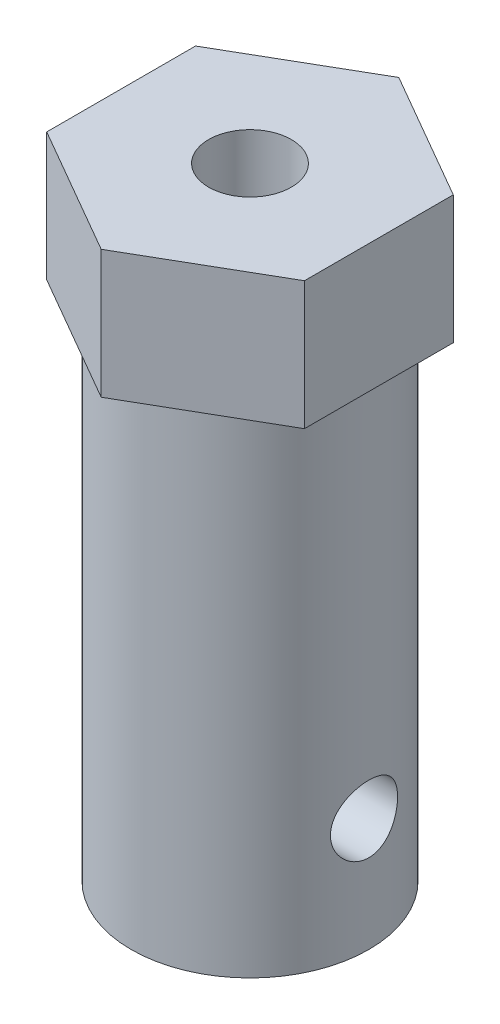
ISO-10303-21;
HEADER;
FILE_DESCRIPTION(('STEP AP214'),'2;1');
FILE_NAME('part.step','',(''),(''),'','','');
FILE_SCHEMA(('AUTOMOTIVE_DESIGN { 1 0 10303 214 1 1 1 1 }'));
ENDSEC;
DATA;
#1=APPLICATION_CONTEXT('core data for automotive mechanical design processes');
#2=APPLICATION_PROTOCOL_DEFINITION('international standard','automotive_design',2000,#1);
#3=PRODUCT_CONTEXT('',#1,'mechanical');
#4=PRODUCT('Part','Part','',(#3));
#5=PRODUCT_RELATED_PRODUCT_CATEGORY('part','',(#4));
#6=PRODUCT_DEFINITION_FORMATION('','',#4);
#7=PRODUCT_DEFINITION_CONTEXT('part definition',#1,'design');
#8=PRODUCT_DEFINITION('design','',#6,#7);
#9=PRODUCT_DEFINITION_SHAPE('','',#8);
#10=(LENGTH_UNIT() NAMED_UNIT(*) SI_UNIT(.MILLI.,.METRE.));
#11=(NAMED_UNIT(*) PLANE_ANGLE_UNIT() SI_UNIT($,.RADIAN.));
#12=(NAMED_UNIT(*) SI_UNIT($,.STERADIAN.) SOLID_ANGLE_UNIT());
#13=UNCERTAINTY_MEASURE_WITH_UNIT(LENGTH_MEASURE(1.E-05),#10,'distance_accuracy_value','');
#14=(GEOMETRIC_REPRESENTATION_CONTEXT(3) GLOBAL_UNCERTAINTY_ASSIGNED_CONTEXT((#13)) GLOBAL_UNIT_ASSIGNED_CONTEXT((#10,
#11,#12)) REPRESENTATION_CONTEXT('',''));
#15=CARTESIAN_POINT('',(0.,0.,0.));
#16=DIRECTION('',(0.,0.,1.));
#17=DIRECTION('',(1.,0.,0.));
#18=AXIS2_PLACEMENT_3D('',#15,#16,#17);
#19=CARTESIAN_POINT('',(0.,30.07,0.));
#20=DIRECTION('',(0.,-1.,0.));
#21=DIRECTION('',(0.,0.,-1.));
#22=AXIS2_PLACEMENT_3D('',#19,#20,#21);
#23=CYLINDRICAL_SURFACE('',#22,5.75);
#24=CARTESIAN_POINT('',(-5.51560286822755,5.475,-1.625));
#25=CARTESIAN_POINT('',(-5.51560417660316,5.56429865379306,-1.62499829342297));
#26=CARTESIAN_POINT('',(-5.51779523459764,5.65361467464507,-1.61761408905678));
#27=CARTESIAN_POINT('',(-5.52629249802826,5.82965247932958,-1.58833758679294));
#28=CARTESIAN_POINT('',(-5.5326004417256,5.91637315115183,-1.56643916053502));
#29=CARTESIAN_POINT('',(-5.54856125355561,6.08464754679471,-1.50892350216074));
#30=CARTESIAN_POINT('',(-5.5582090202718,6.16620892774442,-1.47332718370337));
#31=CARTESIAN_POINT('',(-5.57975573438554,6.32221847617706,-1.38949330030802));
#32=CARTESIAN_POINT('',(-5.59165493388297,6.39666584567586,-1.34125431949896));
#33=CARTESIAN_POINT('',(-5.61673841105354,6.53842478350228,-1.23205487310728));
#34=CARTESIAN_POINT('',(-5.62994765833726,6.6055069835706,-1.17080232047499));
#35=CARTESIAN_POINT('',(-5.65594841513746,6.72859665978229,-1.03794162530569));
#36=CARTESIAN_POINT('',(-5.66873987657006,6.78460286488884,-0.966332295897043));
#37=CARTESIAN_POINT('',(-5.69274477902532,6.88492551185041,-0.813181125241044));
#38=CARTESIAN_POINT('',(-5.70392534641986,6.92901120873354,-0.731482531271048));
#39=CARTESIAN_POINT('',(-5.72316054508144,7.00273190007674,-0.561462956647555));
#40=CARTESIAN_POINT('',(-5.73121577114259,7.0323696444503,-0.473143239903388));
#41=CARTESIAN_POINT('',(-5.74311607189646,7.07560303187119,-0.294785290294256));
#42=CARTESIAN_POINT('',(-5.74706353019839,7.08958948110942,-0.204848740174869));
#43=CARTESIAN_POINT('',(-5.75066269681404,7.10235567422968,-0.0238248503574743));
#44=CARTESIAN_POINT('',(-5.75031520915208,7.10113826431065,0.0672622707614818));
#45=CARTESIAN_POINT('',(-5.74543742828538,7.08380053107798,0.245271554906689));
#46=CARTESIAN_POINT('',(-5.74102577042347,7.0681028769638,0.332238639335848));
#47=CARTESIAN_POINT('',(-5.72865727042011,7.02293660960882,0.502249793183259));
#48=CARTESIAN_POINT('',(-5.72070021464281,6.99346716651297,0.585293625863668));
#49=CARTESIAN_POINT('',(-5.70196459385761,6.92128769049328,0.746145281496307));
#50=CARTESIAN_POINT('',(-5.691156551751,6.87843841565005,0.823887047240685));
#51=CARTESIAN_POINT('',(-5.66787520163886,6.78082391411251,0.971216746442098));
#52=CARTESIAN_POINT('',(-5.65540153552148,6.72605612331898,1.04080292037555));
#53=CARTESIAN_POINT('',(-5.62962718160372,6.60393898602874,1.17236954861864));
#54=CARTESIAN_POINT('',(-5.61631280390536,6.5362219858236,1.23400650107681));
#55=CARTESIAN_POINT('',(-5.59073880725537,6.39127790361115,1.34513951792674));
#56=CARTESIAN_POINT('',(-5.57847927013773,6.31405008488739,1.39463464091202));
#57=CARTESIAN_POINT('',(-5.55634293658501,6.15145833463614,1.48038443345665));
#58=CARTESIAN_POINT('',(-5.54648511901606,6.06603659094724,1.51653473485382));
#59=CARTESIAN_POINT('',(-5.53049843032644,5.88997759027522,1.57384314986441));
#60=CARTESIAN_POINT('',(-5.52436850156595,5.79934182055935,1.59500551598759));
#61=CARTESIAN_POINT('',(-5.51676018566672,5.61866680671758,1.6211221917671));
#62=CARTESIAN_POINT('',(-5.51513349976999,5.52870845979619,1.62659345991373));
#63=CARTESIAN_POINT('',(-5.5163080636355,5.34915994212107,1.62260598503335));
#64=CARTESIAN_POINT('',(-5.51910877493842,5.25956972792368,1.6131490575712));
#65=CARTESIAN_POINT('',(-5.52867821883202,5.08536764276082,1.58003165068348));
#66=CARTESIAN_POINT('',(-5.53535721639384,5.00068934188953,1.55669209655902));
#67=CARTESIAN_POINT('',(-5.55184053561251,4.83645218329522,1.49683799430948));
#68=CARTESIAN_POINT('',(-5.56164530127914,4.75689405481434,1.46032157433693));
#69=CARTESIAN_POINT('',(-5.58357193345863,4.60302074640142,1.37413314727155));
#70=CARTESIAN_POINT('',(-5.59574429566898,4.52887984825657,1.3241631471208));
#71=CARTESIAN_POINT('',(-5.62092071276065,4.38984618835401,1.21284810373815));
#72=CARTESIAN_POINT('',(-5.63392494351563,4.32495539167733,1.15150064984335));
#73=CARTESIAN_POINT('',(-5.65981841877676,4.2040648002513,1.01676252849305));
#74=CARTESIAN_POINT('',(-5.67268976043461,4.14842835278796,0.943041680714833));
#75=CARTESIAN_POINT('',(-5.69643141009309,4.0503144458545,0.787011443385554));
#76=CARTESIAN_POINT('',(-5.70730182334841,4.00783629413914,0.704702505950267));
#77=CARTESIAN_POINT('',(-5.7257472899883,3.93764843439488,0.534405450488067));
#78=CARTESIAN_POINT('',(-5.73334719967993,3.90982695686894,0.446466223456285));
#79=CARTESIAN_POINT('',(-5.74450509855077,3.86943284942777,0.266910694079794));
#80=CARTESIAN_POINT('',(-5.74806410311085,3.8568563887581,0.175295321453896));
#81=CARTESIAN_POINT('',(-5.75068474471028,3.84757351546582,-0.00563507616681675));
#82=CARTESIAN_POINT('',(-5.74989658676585,3.85033708895418,-0.0949210943488967));
#83=CARTESIAN_POINT('',(-5.74425781309807,3.8704082961624,-0.271704917169496));
#84=CARTESIAN_POINT('',(-5.7394073846302,3.88771525948646,-0.35920280404374));
#85=CARTESIAN_POINT('',(-5.72622514831989,3.93606825626258,-0.529206463264629));
#86=CARTESIAN_POINT('',(-5.71792356334072,3.96699515191079,-0.611748622323683));
#87=CARTESIAN_POINT('',(-5.6987019453656,4.04160416078007,-0.7705183553819));
#88=CARTESIAN_POINT('',(-5.68778151289487,4.08528822017997,-0.846744963628009));
#89=CARTESIAN_POINT('',(-5.66408318788558,4.1856571233163,-0.993138916555945));
#90=CARTESIAN_POINT('',(-5.65126032070257,4.24268475455693,-1.06306392291041));
#91=CARTESIAN_POINT('',(-5.62536572054518,4.36748728800809,-1.19253026287679));
#92=CARTESIAN_POINT('',(-5.6122939202683,4.43526513405551,-1.25206874283899));
#93=CARTESIAN_POINT('',(-5.58699296712128,4.58172434685009,-1.36058805712579));
#94=CARTESIAN_POINT('',(-5.57479385620146,4.66063994957478,-1.40926046576311));
#95=CARTESIAN_POINT('',(-5.55306788302131,4.82586871784492,-1.49258259169523));
#96=CARTESIAN_POINT('',(-5.54353948280427,4.91217758835523,-1.52724038456499));
#97=CARTESIAN_POINT('',(-5.5293828544327,5.07748109376031,-1.57766002800148));
#98=CARTESIAN_POINT('',(-5.52426032250385,5.15584477329296,-1.59536760073286));
#99=CARTESIAN_POINT('',(-5.51736999250293,5.31446781439135,-1.61903747440359));
#100=CARTESIAN_POINT('',(-5.51560169209136,5.39472689027391,-1.62500153409082));
#101=CARTESIAN_POINT('',(-5.51560286822755,5.475,-1.625));
#102=B_SPLINE_CURVE_WITH_KNOTS('',3,(#24,#25,#26,#27,#28,#29,#30,#31,#32,#33,#34,#35,#36,#37,
#38,#39,#40,#41,#42,#43,#44,#45,#46,#47,#48,#49,#50,#51,#52,#53,#54,#55,#56,#57,#58,#59,#60,#61,
#62,#63,#64,#65,#66,#67,#68,#69,#70,#71,#72,#73,#74,#75,#76,#77,#78,#79,#80,#81,#82,#83,#84,#85,
#86,#87,#88,#89,#90,#91,#92,#93,#94,#95,#96,#97,#98,#99,#100,#101),.UNSPECIFIED.,.T.,.F.,(4,2,2,
2,2,2,2,2,2,2,2,2,2,2,2,2,2,2,2,2,2,2,2,2,2,2,2,2,2,2,2,2,2,2,2,2,2,2,4),(0.,0.267600361875047,
0.535313785066746,0.802620080333404,1.06995632444201,1.34408507472553,1.61824526469603,
1.8973839806002,2.17646954659856,2.44841913376607,2.720317812081,2.98452281586096,
3.24874374205551,3.51581156456791,3.78293689982543,4.05924098980623,4.33556649602475,
4.61400948728768,4.89237344455494,5.16145477153547,5.43050337540751,5.69356170167318,
5.9566574115659,6.22614345468035,6.49568666205603,6.77411002172573,7.0525187313225,
7.32877242912246,7.60495669573642,7.87165924151668,8.13834949398295,8.40275187647929,
8.6671946161727,8.93936949607837,9.21161903739504,9.49082077026431,9.76986139000983,
10.0104510306059,10.2510046369494),.UNSPECIFIED.);
#103=CARTESIAN_POINT('',(-5.51560286822755,5.475,-1.625));
#104=VERTEX_POINT('',#103);
#105=EDGE_CURVE('E213',#104,#104,#102,.T.);
#106=ORIENTED_EDGE('',*,*,#105,.T.);
#107=EDGE_LOOP('',(#106));
#108=FACE_BOUND('',#107,.T.);
#109=CARTESIAN_POINT('',(5.51560286822755,5.475,-1.625));
#110=CARTESIAN_POINT('',(5.51560417660316,5.38570134620694,-1.62499829342297));
#111=CARTESIAN_POINT('',(5.51779523459764,5.29638532535493,-1.61761408905678));
#112=CARTESIAN_POINT('',(5.52629249802826,5.12034752067042,-1.58833758679294));
#113=CARTESIAN_POINT('',(5.5326004417256,5.03362684884817,-1.56643916053502));
#114=CARTESIAN_POINT('',(5.54856125355561,4.86535245320529,-1.50892350216074));
#115=CARTESIAN_POINT('',(5.5582090202718,4.78379107225558,-1.47332718370337));
#116=CARTESIAN_POINT('',(5.57975573438554,4.62778152382294,-1.38949330030802));
#117=CARTESIAN_POINT('',(5.59165493388297,4.55333415432414,-1.34125431949896));
#118=CARTESIAN_POINT('',(5.61673841105354,4.41157521649772,-1.23205487310728));
#119=CARTESIAN_POINT('',(5.62994765833726,4.3444930164294,-1.17080232047499));
#120=CARTESIAN_POINT('',(5.65594841513746,4.22140334021771,-1.03794162530569));
#121=CARTESIAN_POINT('',(5.66873987657006,4.16539713511116,-0.966332295897042));
#122=CARTESIAN_POINT('',(5.69274477902532,4.06507448814959,-0.813181125241044));
#123=CARTESIAN_POINT('',(5.70392534641986,4.02098879126646,-0.731482531271047));
#124=CARTESIAN_POINT('',(5.72316054508144,3.94726809992326,-0.561462956647555));
#125=CARTESIAN_POINT('',(5.73121577114259,3.9176303555497,-0.473143239903387));
#126=CARTESIAN_POINT('',(5.74311607189646,3.87439696812881,-0.294785290294255));
#127=CARTESIAN_POINT('',(5.74706353019839,3.86041051889058,-0.204848740174868));
#128=CARTESIAN_POINT('',(5.75066269681404,3.84764432577032,-0.0238248503574734));
#129=CARTESIAN_POINT('',(5.75031520915208,3.84886173568935,0.0672622707614827));
#130=CARTESIAN_POINT('',(5.74543742828538,3.86619946892202,0.24527155490669));
#131=CARTESIAN_POINT('',(5.74102577042347,3.8818971230362,0.332238639335849));
#132=CARTESIAN_POINT('',(5.72865727042011,3.92706339039117,0.50224979318326));
#133=CARTESIAN_POINT('',(5.72070021464282,3.95653283348704,0.585293625863669));
#134=CARTESIAN_POINT('',(5.70196459385761,4.02871230950672,0.746145281496308));
#135=CARTESIAN_POINT('',(5.691156551751,4.07156158434995,0.823887047240687));
#136=CARTESIAN_POINT('',(5.66787520163886,4.16917608588749,0.9712167464421));
#137=CARTESIAN_POINT('',(5.65540153552148,4.22394387668103,1.04080292037555));
#138=CARTESIAN_POINT('',(5.62962718160372,4.34606101397126,1.17236954861865));
#139=CARTESIAN_POINT('',(5.61631280390536,4.4137780141764,1.23400650107681));
#140=CARTESIAN_POINT('',(5.59073880725537,4.55872209638885,1.34513951792674));
#141=CARTESIAN_POINT('',(5.57847927013773,4.63594991511262,1.39463464091202));
#142=CARTESIAN_POINT('',(5.55634293658501,4.79854166536386,1.48038443345665));
#143=CARTESIAN_POINT('',(5.54648511901606,4.88396340905276,1.51653473485382));
#144=CARTESIAN_POINT('',(5.53049843032644,5.06002240972478,1.57384314986441));
#145=CARTESIAN_POINT('',(5.52436850156595,5.15065817944065,1.59500551598759));
#146=CARTESIAN_POINT('',(5.51676018566672,5.33133319328242,1.6211221917671));
#147=CARTESIAN_POINT('',(5.51513349976999,5.42129154020381,1.62659345991373));
#148=CARTESIAN_POINT('',(5.5163080636355,5.60084005787893,1.62260598503335));
#149=CARTESIAN_POINT('',(5.51910877493842,5.69043027207632,1.6131490575712));
#150=CARTESIAN_POINT('',(5.52867821883202,5.86463235723918,1.58003165068348));
#151=CARTESIAN_POINT('',(5.53535721639384,5.94931065811047,1.55669209655902));
#152=CARTESIAN_POINT('',(5.55184053561251,6.11354781670478,1.49683799430948));
#153=CARTESIAN_POINT('',(5.56164530127914,6.19310594518566,1.46032157433693));
#154=CARTESIAN_POINT('',(5.58357193345863,6.34697925359858,1.37413314727155));
#155=CARTESIAN_POINT('',(5.59574429566898,6.42112015174343,1.3241631471208));
#156=CARTESIAN_POINT('',(5.62092071276065,6.56015381164599,1.21284810373815));
#157=CARTESIAN_POINT('',(5.63392494351563,6.62504460832267,1.15150064984335));
#158=CARTESIAN_POINT('',(5.65981841877676,6.7459351997487,1.01676252849305));
#159=CARTESIAN_POINT('',(5.67268976043461,6.80157164721204,0.943041680714832));
#160=CARTESIAN_POINT('',(5.69643141009309,6.8996855541455,0.787011443385554));
#161=CARTESIAN_POINT('',(5.70730182334841,6.94216370586086,0.704702505950266));
#162=CARTESIAN_POINT('',(5.7257472899883,7.01235156560512,0.534405450488066));
#163=CARTESIAN_POINT('',(5.73334719967993,7.04017304313106,0.446466223456284));
#164=CARTESIAN_POINT('',(5.74450509855077,7.08056715057223,0.266910694079793));
#165=CARTESIAN_POINT('',(5.74806410311085,7.0931436112419,0.175295321453895));
#166=CARTESIAN_POINT('',(5.75068474471028,7.10242648453418,-0.00563507616681751));
#167=CARTESIAN_POINT('',(5.74989658676585,7.09966291104582,-0.0949210943488972));
#168=CARTESIAN_POINT('',(5.74425781309807,7.0795917038376,-0.271704917169496));
#169=CARTESIAN_POINT('',(5.7394073846302,7.06228474051354,-0.359202804043741));
#170=CARTESIAN_POINT('',(5.72622514831989,7.01393174373742,-0.529206463264629));
#171=CARTESIAN_POINT('',(5.71792356334072,6.98300484808921,-0.611748622323683));
#172=CARTESIAN_POINT('',(5.6987019453656,6.90839583921993,-0.7705183553819));
#173=CARTESIAN_POINT('',(5.68778151289487,6.86471177982003,-0.846744963628009));
#174=CARTESIAN_POINT('',(5.66408318788558,6.7643428766837,-0.993138916555945));
#175=CARTESIAN_POINT('',(5.65126032070257,6.70731524544307,-1.06306392291041));
#176=CARTESIAN_POINT('',(5.62536572054518,6.58251271199191,-1.19253026287679));
#177=CARTESIAN_POINT('',(5.6122939202683,6.51473486594449,-1.25206874283899));
#178=CARTESIAN_POINT('',(5.58699296712128,6.36827565314991,-1.36058805712579));
#179=CARTESIAN_POINT('',(5.57479385620146,6.28936005042522,-1.40926046576311));
#180=CARTESIAN_POINT('',(5.55306788302131,6.12413128215508,-1.49258259169523));
#181=CARTESIAN_POINT('',(5.54353948280428,6.03782241164477,-1.52724038456499));
#182=CARTESIAN_POINT('',(5.5293828544327,5.87251890623969,-1.57766002800148));
#183=CARTESIAN_POINT('',(5.52426032250385,5.79415522670705,-1.59536760073286));
#184=CARTESIAN_POINT('',(5.51736999250293,5.63553218560865,-1.61903747440359));
#185=CARTESIAN_POINT('',(5.51560169209136,5.55527310972609,-1.62500153409082));
#186=CARTESIAN_POINT('',(5.51560286822755,5.475,-1.625));
#187=B_SPLINE_CURVE_WITH_KNOTS('',3,(#109,#110,#111,#112,#113,#114,#115,#116,#117,#118,#119,
#120,#121,#122,#123,#124,#125,#126,#127,#128,#129,#130,#131,#132,#133,#134,#135,#136,#137,#138,
#139,#140,#141,#142,#143,#144,#145,#146,#147,#148,#149,#150,#151,#152,#153,#154,#155,#156,#157,
#158,#159,#160,#161,#162,#163,#164,#165,#166,#167,#168,#169,#170,#171,#172,#173,#174,#175,#176,
#177,#178,#179,#180,#181,#182,#183,#184,#185,#186),.UNSPECIFIED.,.T.,.F.,(4,2,2,2,2,2,2,2,2,2,2,
2,2,2,2,2,2,2,2,2,2,2,2,2,2,2,2,2,2,2,2,2,2,2,2,2,2,2,4),(0.,0.267600361875047,
0.535313785066747,0.802620080333405,1.06995632444202,1.34408507472553,1.61824526469603,
1.8973839806002,2.17646954659856,2.44841913376607,2.720317812081,2.98452281586096,
3.24874374205551,3.51581156456792,3.78293689982544,4.05924098980623,4.33556649602476,
4.61400948728768,4.89237344455494,5.16145477153547,5.43050337540751,5.69356170167318,
5.95665741156591,6.22614345468035,6.49568666205603,6.77411002172573,7.0525187313225,
7.32877242912246,7.60495669573642,7.87165924151668,8.13834949398295,8.4027518764793,
8.66719461617271,8.93936949607837,9.21161903739504,9.49082077026431,9.76986139000984,
10.0104510306059,10.2510046369494),.UNSPECIFIED.);
#188=CARTESIAN_POINT('',(5.51560286822755,5.475,-1.625));
#189=VERTEX_POINT('',#188);
#190=EDGE_CURVE('E207',#189,#189,#187,.T.);
#191=ORIENTED_EDGE('',*,*,#190,.T.);
#192=EDGE_LOOP('',(#191));
#193=FACE_BOUND('',#192,.T.);
#194=CARTESIAN_POINT('',(0.,0.,0.));
#195=DIRECTION('',(0.,1.,0.));
#196=DIRECTION('',(0.,0.,1.));
#197=AXIS2_PLACEMENT_3D('',#194,#195,#196);
#198=CIRCLE('',#197,5.75);
#199=CARTESIAN_POINT('',(0.,0.,5.75));
#200=VERTEX_POINT('',#199);
#201=EDGE_CURVE('E178',#200,#200,#198,.T.);
#202=ORIENTED_EDGE('',*,*,#201,.T.);
#203=EDGE_LOOP('',(#202));
#204=FACE_BOUND('',#203,.T.);
#205=CARTESIAN_POINT('',(0.,23.87,0.));
#206=DIRECTION('',(0.,1.,0.));
#207=DIRECTION('',(0.,0.,1.));
#208=AXIS2_PLACEMENT_3D('',#205,#206,#207);
#209=CIRCLE('',#208,5.75);
#210=CARTESIAN_POINT('',(0.,23.87,5.75));
#211=VERTEX_POINT('',#210);
#212=EDGE_CURVE('E11',#211,#211,#209,.T.);
#213=ORIENTED_EDGE('',*,*,#212,.F.);
#214=EDGE_LOOP('',(#213));
#215=FACE_BOUND('',#214,.T.);
#216=ADVANCED_FACE('F38',(#108,#193,#204,#215),#23,.T.);
#217=CARTESIAN_POINT('',(0.,0.,0.));
#218=DIRECTION('',(0.,1.,0.));
#219=DIRECTION('',(0.,0.,1.));
#220=AXIS2_PLACEMENT_3D('',#217,#218,#219);
#221=CYLINDRICAL_SURFACE('',#220,3.34);
#222=CARTESIAN_POINT('',(-2.91804300859326,5.475,-1.625));
#223=CARTESIAN_POINT('',(-2.91804976005883,5.38997542525232,-1.62499442384154));
#224=CARTESIAN_POINT('',(-2.9218149984292,5.30483560724234,-1.61828284987486));
#225=CARTESIAN_POINT('',(-2.9363406411164,5.13714108359835,-1.59176581656082));
#226=CARTESIAN_POINT('',(-2.94711652831724,5.05459252470226,-1.57193137396055));
#227=CARTESIAN_POINT('',(-2.97412292230692,4.89481930023772,-1.52020760690314));
#228=CARTESIAN_POINT('',(-2.99032559202378,4.81756984094225,-1.48837970162152));
#229=CARTESIAN_POINT('',(-3.02631706947505,4.66952589123785,-1.41375935497255));
#230=CARTESIAN_POINT('',(-3.04610590311996,4.5987314474728,-1.37096683438351));
#231=CARTESIAN_POINT('',(-3.08892591826826,4.45951256355307,-1.27172121812721));
#232=CARTESIAN_POINT('',(-3.11208958675368,4.39170192400024,-1.2144638719736));
#233=CARTESIAN_POINT('',(-3.15797733462039,4.26617259925702,-1.08958925293965));
#234=CARTESIAN_POINT('',(-3.18070119986454,4.2084587253776,-1.02196706964568));
#235=CARTESIAN_POINT('',(-3.22486253653109,4.10120871232759,-0.873072379502813));
#236=CARTESIAN_POINT('',(-3.24612880917962,4.05241670627999,-0.791208338062668));
#237=CARTESIAN_POINT('',(-3.28327627114841,3.96957531965864,-0.619206254071386));
#238=CARTESIAN_POINT('',(-3.29916068085726,3.93551711930929,-0.529073200697011));
#239=CARTESIAN_POINT('',(-3.32280275158299,3.8855050536807,-0.349585302698653));
#240=CARTESIAN_POINT('',(-3.33103942157056,3.868477940988,-0.260594006527878));
#241=CARTESIAN_POINT('',(-3.34023798946381,3.84948828924259,-0.0806650213564646));
#242=CARTESIAN_POINT('',(-3.34120402361224,3.84751718486273,0.0102715314575794));
#243=CARTESIAN_POINT('',(-3.33598925730552,3.85825541381376,0.183487439809333));
#244=CARTESIAN_POINT('',(-3.33039110207279,3.86976783540924,0.265862434427483));
#245=CARTESIAN_POINT('',(-3.31354387894068,3.90502004074335,0.427338812593501));
#246=CARTESIAN_POINT('',(-3.30229438981509,3.92876073592843,0.506439951646442));
#247=CARTESIAN_POINT('',(-3.2749816641775,3.98798022998959,0.660539543204467));
#248=CARTESIAN_POINT('',(-3.25885162225746,4.02362269185549,0.735462770073897));
#249=CARTESIAN_POINT('',(-3.22325295586211,4.10542361119009,0.878451801538527));
#250=CARTESIAN_POINT('',(-3.20378311929576,4.15158588855555,0.946515102215552));
#251=CARTESIAN_POINT('',(-3.16126985294014,4.25793830428353,1.08043771996552));
#252=CARTESIAN_POINT('',(-3.13806246516681,4.31902122188745,1.14553668388549));
#253=CARTESIAN_POINT('',(-3.09185593979215,4.45107434850219,1.2649646512955));
#254=CARTESIAN_POINT('',(-3.06885695831077,4.52205140686174,1.31928613025716));
#255=CARTESIAN_POINT('',(-3.02425456350093,4.67691338661715,1.41866962801354));
#256=CARTESIAN_POINT('',(-3.00280819251396,4.76130672765648,1.46301672424018));
#257=CARTESIAN_POINT('',(-2.96585996025852,4.93765386817421,1.53654998605012));
#258=CARTESIAN_POINT('',(-2.95035218485563,5.02960003449464,1.56575124541326));
#259=CARTESIAN_POINT('',(-2.92869825538592,5.21090117757321,1.60586792490121));
#260=CARTESIAN_POINT('',(-2.92191838736615,5.29990248350445,1.6180277414102));
#261=CARTESIAN_POINT('',(-2.91667771343232,5.47891207997264,1.62746075208073));
#262=CARTESIAN_POINT('',(-2.91821171024942,5.56891970631034,1.62474324653211));
#263=CARTESIAN_POINT('',(-2.92875541915787,5.73772839497872,1.60564069389593));
#264=CARTESIAN_POINT('',(-2.93699560467067,5.81674419773692,1.59066165524411));
#265=CARTESIAN_POINT('',(-2.95891201192384,5.97100673335276,1.54950926039207));
#266=CARTESIAN_POINT('',(-2.97258988303268,6.04625231481521,1.52333250749796));
#267=CARTESIAN_POINT('',(-3.00459147528454,6.19479718963235,1.45923434133128));
#268=CARTESIAN_POINT('',(-3.02310140493879,6.2678439391144,1.42082408782913));
#269=CARTESIAN_POINT('',(-3.062499281058,6.40686928850959,1.33378374075606));
#270=CARTESIAN_POINT('',(-3.08338843375784,6.47284426993278,1.28514845256283));
#271=CARTESIAN_POINT('',(-3.12815719470902,6.60399543184501,1.17231877994646));
#272=CARTESIAN_POINT('',(-3.15209872579283,6.668157955757,1.10696542997073));
#273=CARTESIAN_POINT('',(-3.1981140120787,6.78490053630133,0.966003017820354));
#274=CARTESIAN_POINT('',(-3.22018723877044,6.83747732223271,0.890391069310117));
#275=CARTESIAN_POINT('',(-3.26060420214438,6.93045784208405,0.728789260202494));
#276=CARTESIAN_POINT('',(-3.27885865101549,6.97057894486833,0.642612907057672));
#277=CARTESIAN_POINT('',(-3.30891112641567,7.03536781927002,0.463592049068459));
#278=CARTESIAN_POINT('',(-3.3207145194997,7.06004843811913,0.370753159674315));
#279=CARTESIAN_POINT('',(-3.33571981575368,7.09123573853148,0.189916945734807));
#280=CARTESIAN_POINT('',(-3.33959065611099,7.09915783195959,0.10221855150251));
#281=CARTESIAN_POINT('',(-3.34034684723765,7.10071371120034,-0.0733229253511546));
#282=CARTESIAN_POINT('',(-3.33723438715967,7.09435197476409,-0.161165954005466));
#283=CARTESIAN_POINT('',(-3.32476324562683,7.06848379320307,-0.328949343545443));
#284=CARTESIAN_POINT('',(-3.31579200902171,7.04979201442206,-0.409047040739861));
#285=CARTESIAN_POINT('',(-3.2928320403603,7.00085498668811,-0.564856535385057));
#286=CARTESIAN_POINT('',(-3.27884255085357,6.97060799355701,-0.640567668727071));
#287=CARTESIAN_POINT('',(-3.2463550922209,6.89800574703135,-0.789189936989615));
#288=CARTESIAN_POINT('',(-3.22768550904769,6.85517535267663,-0.861830356907343));
#289=CARTESIAN_POINT('',(-3.18783898396979,6.75922974379929,-0.999203089421628));
#290=CARTESIAN_POINT('',(-3.16666089034172,6.70610979790515,-1.06393174158779));
#291=CARTESIAN_POINT('',(-3.12156699024656,6.58524360048637,-1.19009279647811));
#292=CARTESIAN_POINT('',(-3.09758186397022,6.51658857013812,-1.25063237432455));
#293=CARTESIAN_POINT('',(-3.05131585419779,6.36965602582863,-1.3596275487351));
#294=CARTESIAN_POINT('',(-3.02903635546268,6.2913708249804,-1.4080733973166));
#295=CARTESIAN_POINT('',(-2.98841176116418,6.12484372156964,-1.49239547984207));
#296=CARTESIAN_POINT('',(-2.97017255844621,6.03640965040691,-1.52794620524334));
#297=CARTESIAN_POINT('',(-2.94114790746247,5.85370215440564,-1.58311312510418));
#298=CARTESIAN_POINT('',(-2.93033747941817,5.75944947202427,-1.60278276027264));
#299=CARTESIAN_POINT('',(-2.9221323917402,5.63272623605161,-1.61763746746193));
#300=CARTESIAN_POINT('',(-2.92060361620918,5.60126973898214,-1.62039461237484));
#301=CARTESIAN_POINT('',(-2.91855763848832,5.53821414487903,-1.62407697136876));
#302=CARTESIAN_POINT('',(-2.91804049816789,5.50661503924221,-1.62500207340606));
#303=CARTESIAN_POINT('',(-2.91804300859326,5.475,-1.625));
#304=B_SPLINE_CURVE_WITH_KNOTS('',3,(#222,#223,#224,#225,#226,#227,#228,#229,#230,#231,#232,
#233,#234,#235,#236,#237,#238,#239,#240,#241,#242,#243,#244,#245,#246,#247,#248,#249,#250,#251,
#252,#253,#254,#255,#256,#257,#258,#259,#260,#261,#262,#263,#264,#265,#266,#267,#268,#269,#270,
#271,#272,#273,#274,#275,#276,#277,#278,#279,#280,#281,#282,#283,#284,#285,#286,#287,#288,#289,
#290,#291,#292,#293,#294,#295,#296,#297,#298,#299,#300,#301,#302,#303),.UNSPECIFIED.,.T.,.F.,(4,
2,2,2,2,2,2,2,2,2,2,2,2,2,2,2,2,2,2,2,2,2,2,2,2,2,2,2,2,2,2,2,2,2,2,2,2,2,2,2,4),(0.,
0.254940807677494,0.510446567329305,0.764661268293461,1.01887780606493,1.29288960755969,
1.56703162759946,1.85844227869623,2.14967824681968,2.42111799947116,2.6924033191868,
2.94132287985667,3.19026099667725,3.44277385089733,3.69537854269157,3.97090367559325,
4.24662050044054,4.53824263047053,4.8295735795815,5.09827059012597,5.36679964876315,
5.608247591945,5.84976882749188,6.10250301363999,6.35536590789723,6.63807839923744,
6.92087059950691,7.20967629643462,7.49824137229702,7.76126168322789,8.02419955303067,
8.27130289835387,8.5184435569319,8.77648289177361,9.03464116188916,9.31724996870114,
9.60008583819955,9.88963247279002,10.1782006585633,10.2729905564105,10.3677862512209),.UNSPECIFIED.);
#305=CARTESIAN_POINT('',(-2.91804300859326,5.475,-1.625));
#306=VERTEX_POINT('',#305);
#307=EDGE_CURVE('E42',#306,#306,#304,.T.);
#308=ORIENTED_EDGE('',*,*,#307,.T.);
#309=EDGE_LOOP('',(#308));
#310=FACE_BOUND('',#309,.T.);
#311=CARTESIAN_POINT('',(2.91804300859326,5.475,-1.625));
#312=CARTESIAN_POINT('',(2.91804976005883,5.56002457474768,-1.62499442384154));
#313=CARTESIAN_POINT('',(2.92181499842921,5.64516439275766,-1.61828284987486));
#314=CARTESIAN_POINT('',(2.9363406411164,5.81285891640165,-1.59176581656082));
#315=CARTESIAN_POINT('',(2.94711652831724,5.89540747529774,-1.57193137396055));
#316=CARTESIAN_POINT('',(2.97412292230692,6.05518069976228,-1.52020760690314));
#317=CARTESIAN_POINT('',(2.99032559202378,6.13243015905775,-1.48837970162152));
#318=CARTESIAN_POINT('',(3.02631706947505,6.28047410876215,-1.41375935497255));
#319=CARTESIAN_POINT('',(3.04610590311996,6.3512685525272,-1.37096683438351));
#320=CARTESIAN_POINT('',(3.08892591826826,6.49048743644693,-1.27172121812721));
#321=CARTESIAN_POINT('',(3.11208958675368,6.55829807599976,-1.2144638719736));
#322=CARTESIAN_POINT('',(3.15797733462039,6.68382740074298,-1.08958925293965));
#323=CARTESIAN_POINT('',(3.18070119986454,6.7415412746224,-1.02196706964568));
#324=CARTESIAN_POINT('',(3.22486253653109,6.84879128767241,-0.873072379502813));
#325=CARTESIAN_POINT('',(3.24612880917962,6.89758329372001,-0.791208338062668));
#326=CARTESIAN_POINT('',(3.28327627114841,6.98042468034136,-0.619206254071386));
#327=CARTESIAN_POINT('',(3.29916068085726,7.01448288069071,-0.529073200697011));
#328=CARTESIAN_POINT('',(3.32280275158299,7.0644949463193,-0.349585302698653));
#329=CARTESIAN_POINT('',(3.33103942157056,7.081522059012,-0.260594006527878));
#330=CARTESIAN_POINT('',(3.34023798946381,7.10051171075741,-0.0806650213564643));
#331=CARTESIAN_POINT('',(3.34120402361224,7.10248281513727,0.0102715314575797));
#332=CARTESIAN_POINT('',(3.33598925730552,7.09174458618624,0.183487439809333));
#333=CARTESIAN_POINT('',(3.33039110207279,7.08023216459076,0.265862434427483));
#334=CARTESIAN_POINT('',(3.31354387894068,7.04497995925665,0.427338812593501));
#335=CARTESIAN_POINT('',(3.30229438981509,7.02123926407157,0.506439951646442));
#336=CARTESIAN_POINT('',(3.2749816641775,6.96201977001041,0.660539543204467));
#337=CARTESIAN_POINT('',(3.25885162225746,6.92637730814451,0.735462770073897));
#338=CARTESIAN_POINT('',(3.22325295586211,6.84457638880991,0.878451801538527));
#339=CARTESIAN_POINT('',(3.20378311929576,6.79841411144445,0.946515102215552));
#340=CARTESIAN_POINT('',(3.16126985294014,6.69206169571647,1.08043771996552));
#341=CARTESIAN_POINT('',(3.13806246516681,6.63097877811255,1.14553668388549));
#342=CARTESIAN_POINT('',(3.09185593979215,6.49892565149781,1.2649646512955));
#343=CARTESIAN_POINT('',(3.06885695831077,6.42794859313825,1.31928613025716));
#344=CARTESIAN_POINT('',(3.02425456350093,6.27308661338285,1.41866962801354));
#345=CARTESIAN_POINT('',(3.00280819251396,6.18869327234352,1.46301672424018));
#346=CARTESIAN_POINT('',(2.96585996025852,6.01234613182579,1.53654998605012));
#347=CARTESIAN_POINT('',(2.95035218485563,5.92039996550536,1.56575124541326));
#348=CARTESIAN_POINT('',(2.92869825538592,5.73909882242679,1.60586792490121));
#349=CARTESIAN_POINT('',(2.92191838736615,5.65009751649555,1.6180277414102));
#350=CARTESIAN_POINT('',(2.91667771343232,5.47108792002736,1.62746075208073));
#351=CARTESIAN_POINT('',(2.91821171024942,5.38108029368966,1.62474324653211));
#352=CARTESIAN_POINT('',(2.92875541915787,5.21227160502128,1.60564069389593));
#353=CARTESIAN_POINT('',(2.93699560467067,5.13325580226308,1.59066165524411));
#354=CARTESIAN_POINT('',(2.95891201192384,4.97899326664724,1.54950926039207));
#355=CARTESIAN_POINT('',(2.97258988303268,4.90374768518479,1.52333250749796));
#356=CARTESIAN_POINT('',(3.00459147528454,4.75520281036765,1.45923434133128));
#357=CARTESIAN_POINT('',(3.02310140493879,4.68215606088559,1.42082408782913));
#358=CARTESIAN_POINT('',(3.062499281058,4.54313071149041,1.33378374075606));
#359=CARTESIAN_POINT('',(3.08338843375784,4.47715573006722,1.28514845256283));
#360=CARTESIAN_POINT('',(3.12815719470902,4.34600456815499,1.17231877994646));
#361=CARTESIAN_POINT('',(3.15209872579283,4.281842044243,1.10696542997073));
#362=CARTESIAN_POINT('',(3.1981140120787,4.16509946369867,0.966003017820354));
#363=CARTESIAN_POINT('',(3.22018723877044,4.11252267776729,0.890391069310117));
#364=CARTESIAN_POINT('',(3.26060420214438,4.01954215791595,0.728789260202493));
#365=CARTESIAN_POINT('',(3.27885865101549,3.97942105513167,0.642612907057671));
#366=CARTESIAN_POINT('',(3.30891112641567,3.91463218072998,0.463592049068458));
#367=CARTESIAN_POINT('',(3.3207145194997,3.88995156188087,0.370753159674314));
#368=CARTESIAN_POINT('',(3.33571981575368,3.85876426146852,0.189916945734805));
#369=CARTESIAN_POINT('',(3.33959065611099,3.85084216804041,0.102218551502509));
#370=CARTESIAN_POINT('',(3.34034684723765,3.84928628879965,-0.0733229253511558));
#371=CARTESIAN_POINT('',(3.33723438715967,3.85564802523591,-0.161165954005468));
#372=CARTESIAN_POINT('',(3.32476324562683,3.88151620679693,-0.328949343545444));
#373=CARTESIAN_POINT('',(3.31579200902171,3.90020798557794,-0.409047040739861));
#374=CARTESIAN_POINT('',(3.2928320403603,3.94914501331189,-0.564856535385057));
#375=CARTESIAN_POINT('',(3.27884255085357,3.97939200644299,-0.640567668727072));
#376=CARTESIAN_POINT('',(3.2463550922209,4.05199425296865,-0.789189936989616));
#377=CARTESIAN_POINT('',(3.22768550904769,4.09482464732337,-0.861830356907343));
#378=CARTESIAN_POINT('',(3.18783898396979,4.19077025620071,-0.999203089421628));
#379=CARTESIAN_POINT('',(3.16666089034172,4.24389020209485,-1.06393174158779));
#380=CARTESIAN_POINT('',(3.12156699024656,4.36475639951363,-1.19009279647811));
#381=CARTESIAN_POINT('',(3.09758186397022,4.43341142986188,-1.25063237432455));
#382=CARTESIAN_POINT('',(3.05131585419779,4.58034397417137,-1.3596275487351));
#383=CARTESIAN_POINT('',(3.02903635546268,4.6586291750196,-1.4080733973166));
#384=CARTESIAN_POINT('',(2.98841176116418,4.82515627843036,-1.49239547984207));
#385=CARTESIAN_POINT('',(2.97017255844621,4.91359034959309,-1.52794620524334));
#386=CARTESIAN_POINT('',(2.94114790746247,5.09629784559436,-1.58311312510418));
#387=CARTESIAN_POINT('',(2.93033747941817,5.19055052797573,-1.60278276027264));
#388=CARTESIAN_POINT('',(2.9221323917402,5.31727376394839,-1.61763746746193));
#389=CARTESIAN_POINT('',(2.92060361620918,5.34873026101787,-1.62039461237484));
#390=CARTESIAN_POINT('',(2.91855763848832,5.41178585512098,-1.62407697136876));
#391=CARTESIAN_POINT('',(2.9180404981679,5.44338496075779,-1.62500207340606));
#392=CARTESIAN_POINT('',(2.91804300859326,5.475,-1.625));
#393=B_SPLINE_CURVE_WITH_KNOTS('',3,(#311,#312,#313,#314,#315,#316,#317,#318,#319,#320,#321,
#322,#323,#324,#325,#326,#327,#328,#329,#330,#331,#332,#333,#334,#335,#336,#337,#338,#339,#340,
#341,#342,#343,#344,#345,#346,#347,#348,#349,#350,#351,#352,#353,#354,#355,#356,#357,#358,#359,
#360,#361,#362,#363,#364,#365,#366,#367,#368,#369,#370,#371,#372,#373,#374,#375,#376,#377,#378,
#379,#380,#381,#382,#383,#384,#385,#386,#387,#388,#389,#390,#391,#392),.UNSPECIFIED.,.T.,.F.,(4,
2,2,2,2,2,2,2,2,2,2,2,2,2,2,2,2,2,2,2,2,2,2,2,2,2,2,2,2,2,2,2,2,2,2,2,2,2,2,2,4),(0.,
0.254940807677494,0.510446567329305,0.764661268293461,1.01887780606493,1.29288960755969,
1.56703162759946,1.85844227869623,2.14967824681968,2.42111799947116,2.6924033191868,
2.94132287985667,3.19026099667725,3.44277385089733,3.69537854269157,3.97090367559325,
4.24662050044054,4.53824263047053,4.8295735795815,5.09827059012596,5.36679964876315,
5.608247591945,5.84976882749188,6.10250301363999,6.35536590789723,6.63807839923744,
6.92087059950691,7.20967629643462,7.49824137229702,7.76126168322789,8.02419955303067,
8.27130289835387,8.5184435569319,8.77648289177361,9.03464116188916,9.31724996870114,
9.60008583819955,9.88963247279002,10.1782006585633,10.2729905564105,10.3677862512209),.UNSPECIFIED.);
#394=CARTESIAN_POINT('',(2.91804300859326,5.475,-1.625));
#395=VERTEX_POINT('',#394);
#396=EDGE_CURVE('E184',#395,#395,#393,.T.);
#397=ORIENTED_EDGE('',*,*,#396,.T.);
#398=EDGE_LOOP('',(#397));
#399=FACE_BOUND('',#398,.T.);
#400=CARTESIAN_POINT('',(0.,0.,0.));
#401=DIRECTION('',(0.,1.,0.));
#402=DIRECTION('',(0.,0.,1.));
#403=AXIS2_PLACEMENT_3D('',#400,#401,#402);
#404=CIRCLE('',#403,3.34);
#405=CARTESIAN_POINT('',(0.,0.,3.34));
#406=VERTEX_POINT('',#405);
#407=EDGE_CURVE('E165',#406,#406,#404,.T.);
#408=ORIENTED_EDGE('',*,*,#407,.F.);
#409=EDGE_LOOP('',(#408));
#410=FACE_BOUND('',#409,.T.);
#411=CARTESIAN_POINT('',(0.,23.87,0.));
#412=DIRECTION('',(0.,1.,0.));
#413=DIRECTION('',(0.,0.,1.));
#414=AXIS2_PLACEMENT_3D('',#411,#412,#413);
#415=CIRCLE('',#414,3.34);
#416=CARTESIAN_POINT('',(0.,23.87,3.34));
#417=VERTEX_POINT('',#416);
#418=EDGE_CURVE('E54',#417,#417,#415,.F.);
#419=ORIENTED_EDGE('',*,*,#418,.F.);
#420=EDGE_LOOP('',(#419));
#421=FACE_BOUND('',#420,.T.);
#422=ADVANCED_FACE('F190',(#310,#399,#410,#421),#221,.F.);
#423=CARTESIAN_POINT('',(0.,0.,0.));
#424=DIRECTION('',(0.,1.,0.));
#425=DIRECTION('',(0.,0.,1.));
#426=AXIS2_PLACEMENT_3D('',#423,#424,#425);
#427=PLANE('',#426);
#428=ORIENTED_EDGE('',*,*,#407,.T.);
#429=EDGE_LOOP('',(#428));
#430=FACE_BOUND('',#429,.T.);
#431=ORIENTED_EDGE('',*,*,#201,.F.);
#432=EDGE_LOOP('',(#431));
#433=FACE_BOUND('',#432,.T.);
#434=ADVANCED_FACE('F247',(#430,#433),#427,.F.);
#435=CARTESIAN_POINT('',(0.,23.87,0.));
#436=DIRECTION('',(0.,1.,0.));
#437=DIRECTION('',(0.,0.,1.));
#438=AXIS2_PLACEMENT_3D('',#435,#436,#437);
#439=PLANE('',#438);
#440=CARTESIAN_POINT('',(0.,23.87,0.));
#441=DIRECTION('',(0.,1.,0.));
#442=DIRECTION('',(0.,0.,1.));
#443=AXIS2_PLACEMENT_3D('',#440,#441,#442);
#444=CIRCLE('',#443,2.);
#445=CARTESIAN_POINT('',(0.,23.87,2.));
#446=VERTEX_POINT('',#445);
#447=EDGE_CURVE('E145',#446,#446,#444,.T.);
#448=ORIENTED_EDGE('',*,*,#447,.T.);
#449=EDGE_LOOP('',(#448));
#450=FACE_BOUND('',#449,.T.);
#451=ORIENTED_EDGE('',*,*,#418,.T.);
#452=EDGE_LOOP('',(#451));
#453=FACE_BOUND('',#452,.T.);
#454=ADVANCED_FACE('F257',(#450,#453),#439,.F.);
#455=DIRECTION('',(0.866025403784438,0.,0.500000000000001));
#456=VECTOR('',#455,1.);
#457=CARTESIAN_POINT('',(-6.23538290724796,23.87,3.6));
#458=LINE('',#457,#456);
#459=CARTESIAN_POINT('',(-6.23538290724796,23.87,3.6));
#460=VERTEX_POINT('',#459);
#461=CARTESIAN_POINT('',(0.,23.87,7.2));
#462=VERTEX_POINT('',#461);
#463=EDGE_CURVE('E162',#460,#462,#458,.T.);
#464=ORIENTED_EDGE('',*,*,#463,.F.);
#465=DIRECTION('',(0.,0.,1.));
#466=VECTOR('',#465,1.);
#467=CARTESIAN_POINT('',(-6.23538290724796,23.87,-3.6));
#468=LINE('',#467,#466);
#469=CARTESIAN_POINT('',(-6.23538290724796,23.87,-3.6));
#470=VERTEX_POINT('',#469);
#471=EDGE_CURVE('E126',#470,#460,#468,.T.);
#472=ORIENTED_EDGE('',*,*,#471,.F.);
#473=DIRECTION('',(-0.866025403784439,0.,0.499999999999999));
#474=VECTOR('',#473,1.);
#475=CARTESIAN_POINT('',(0.,23.87,-7.2));
#476=LINE('',#475,#474);
#477=CARTESIAN_POINT('',(0.,23.87,-7.2));
#478=VERTEX_POINT('',#477);
#479=EDGE_CURVE('E109',#478,#470,#476,.T.);
#480=ORIENTED_EDGE('',*,*,#479,.F.);
#481=DIRECTION('',(-0.866025403784438,0.,-0.500000000000001));
#482=VECTOR('',#481,1.);
#483=CARTESIAN_POINT('',(6.23538290724796,23.87,-3.59999999999999));
#484=LINE('',#483,#482);
#485=CARTESIAN_POINT('',(6.23538290724796,23.87,-3.59999999999999));
#486=VERTEX_POINT('',#485);
#487=EDGE_CURVE('E124',#486,#478,#484,.T.);
#488=ORIENTED_EDGE('',*,*,#487,.F.);
#489=DIRECTION('',(0.,0.,-1.));
#490=VECTOR('',#489,1.);
#491=CARTESIAN_POINT('',(6.23538290724796,23.87,3.6));
#492=LINE('',#491,#490);
#493=CARTESIAN_POINT('',(6.23538290724796,23.87,3.6));
#494=VERTEX_POINT('',#493);
#495=EDGE_CURVE('E131',#494,#486,#492,.T.);
#496=ORIENTED_EDGE('',*,*,#495,.F.);
#497=DIRECTION('',(0.866025403784439,0.,-0.499999999999999));
#498=VECTOR('',#497,1.);
#499=CARTESIAN_POINT('',(0.,23.87,7.2));
#500=LINE('',#499,#498);
#501=EDGE_CURVE('E134',#462,#494,#500,.T.);
#502=ORIENTED_EDGE('',*,*,#501,.F.);
#503=EDGE_LOOP('',(#464,#472,#480,#488,#496,#502));
#504=FACE_BOUND('',#503,.T.);
#505=ORIENTED_EDGE('',*,*,#212,.T.);
#506=EDGE_LOOP('',(#505));
#507=FACE_BOUND('',#506,.T.);
#508=ADVANCED_FACE('F121',(#504,#507),#439,.F.);
#509=CARTESIAN_POINT('',(-6.23538290724796,23.87,3.6));
#510=DIRECTION('',(-0.500000000000001,0.,0.866025403784438));
#511=DIRECTION('',(0.866025403784438,0.,0.500000000000001));
#512=AXIS2_PLACEMENT_3D('',#509,#510,#511);
#513=PLANE('',#512);
#514=DIRECTION('',(0.866025403784438,0.,0.500000000000001));
#515=VECTOR('',#514,1.);
#516=CARTESIAN_POINT('',(-6.23538290724796,30.07,3.6));
#517=LINE('',#516,#515);
#518=CARTESIAN_POINT('',(-6.23538290724796,30.07,3.6));
#519=VERTEX_POINT('',#518);
#520=CARTESIAN_POINT('',(0.,30.07,7.2));
#521=VERTEX_POINT('',#520);
#522=EDGE_CURVE('E140',#519,#521,#517,.T.);
#523=ORIENTED_EDGE('',*,*,#522,.F.);
#524=DIRECTION('',(0.,1.,0.));
#525=VECTOR('',#524,1.);
#526=CARTESIAN_POINT('',(-6.23538290724796,23.87,3.6));
#527=LINE('',#526,#525);
#528=EDGE_CURVE('E63',#460,#519,#527,.T.);
#529=ORIENTED_EDGE('',*,*,#528,.F.);
#530=ORIENTED_EDGE('',*,*,#463,.T.);
#531=DIRECTION('',(0.,1.,0.));
#532=VECTOR('',#531,1.);
#533=CARTESIAN_POINT('',(0.,23.87,7.2));
#534=LINE('',#533,#532);
#535=EDGE_CURVE('E98',#462,#521,#534,.T.);
#536=ORIENTED_EDGE('',*,*,#535,.T.);
#537=EDGE_LOOP('',(#523,#529,#530,#536));
#538=FACE_BOUND('',#537,.T.);
#539=ADVANCED_FACE('F231',(#538),#513,.T.);
#540=CARTESIAN_POINT('',(-6.23538290724796,23.87,-3.6));
#541=DIRECTION('',(-1.,0.,0.));
#542=DIRECTION('',(0.,0.,1.));
#543=AXIS2_PLACEMENT_3D('',#540,#541,#542);
#544=PLANE('',#543);
#545=DIRECTION('',(0.,0.,1.));
#546=VECTOR('',#545,1.);
#547=CARTESIAN_POINT('',(-6.23538290724796,30.07,-3.6));
#548=LINE('',#547,#546);
#549=CARTESIAN_POINT('',(-6.23538290724796,30.07,-3.6));
#550=VERTEX_POINT('',#549);
#551=EDGE_CURVE('E158',#550,#519,#548,.T.);
#552=ORIENTED_EDGE('',*,*,#551,.F.);
#553=DIRECTION('',(0.,1.,0.));
#554=VECTOR('',#553,1.);
#555=CARTESIAN_POINT('',(-6.23538290724796,23.87,-3.6));
#556=LINE('',#555,#554);
#557=EDGE_CURVE('E86',#470,#550,#556,.T.);
#558=ORIENTED_EDGE('',*,*,#557,.F.);
#559=ORIENTED_EDGE('',*,*,#471,.T.);
#560=ORIENTED_EDGE('',*,*,#528,.T.);
#561=EDGE_LOOP('',(#552,#558,#559,#560));
#562=FACE_BOUND('',#561,.T.);
#563=ADVANCED_FACE('F234',(#562),#544,.T.);
#564=CARTESIAN_POINT('',(0.,23.87,-7.2));
#565=DIRECTION('',(-0.499999999999999,0.,-0.866025403784439));
#566=DIRECTION('',(-0.866025403784439,0.,0.5));
#567=AXIS2_PLACEMENT_3D('',#564,#565,#566);
#568=PLANE('',#567);
#569=DIRECTION('',(-0.866025403784439,0.,0.499999999999999));
#570=VECTOR('',#569,1.);
#571=CARTESIAN_POINT('',(0.,30.07,-7.2));
#572=LINE('',#571,#570);
#573=CARTESIAN_POINT('',(0.,30.07,-7.2));
#574=VERTEX_POINT('',#573);
#575=EDGE_CURVE('E111',#574,#550,#572,.T.);
#576=ORIENTED_EDGE('',*,*,#575,.F.);
#577=DIRECTION('',(0.,1.,0.));
#578=VECTOR('',#577,1.);
#579=CARTESIAN_POINT('',(0.,23.87,-7.2));
#580=LINE('',#579,#578);
#581=EDGE_CURVE('E106',#478,#574,#580,.T.);
#582=ORIENTED_EDGE('',*,*,#581,.F.);
#583=ORIENTED_EDGE('',*,*,#479,.T.);
#584=ORIENTED_EDGE('',*,*,#557,.T.);
#585=EDGE_LOOP('',(#576,#582,#583,#584));
#586=FACE_BOUND('',#585,.T.);
#587=ADVANCED_FACE('F108',(#586),#568,.T.);
#588=CARTESIAN_POINT('',(6.23538290724796,23.87,-3.59999999999999));
#589=DIRECTION('',(0.500000000000001,0.,-0.866025403784438));
#590=DIRECTION('',(-0.866025403784438,0.,-0.500000000000001));
#591=AXIS2_PLACEMENT_3D('',#588,#589,#590);
#592=PLANE('',#591);
#593=DIRECTION('',(-0.866025403784438,0.,-0.500000000000001));
#594=VECTOR('',#593,1.);
#595=CARTESIAN_POINT('',(6.23538290724796,30.07,-3.59999999999999));
#596=LINE('',#595,#594);
#597=CARTESIAN_POINT('',(6.23538290724796,30.07,-3.59999999999999));
#598=VERTEX_POINT('',#597);
#599=EDGE_CURVE('E153',#598,#574,#596,.T.);
#600=ORIENTED_EDGE('',*,*,#599,.F.);
#601=DIRECTION('',(0.,1.,0.));
#602=VECTOR('',#601,1.);
#603=CARTESIAN_POINT('',(6.23538290724796,23.87,-3.59999999999999));
#604=LINE('',#603,#602);
#605=EDGE_CURVE('E117',#486,#598,#604,.T.);
#606=ORIENTED_EDGE('',*,*,#605,.F.);
#607=ORIENTED_EDGE('',*,*,#487,.T.);
#608=ORIENTED_EDGE('',*,*,#581,.T.);
#609=EDGE_LOOP('',(#600,#606,#607,#608));
#610=FACE_BOUND('',#609,.T.);
#611=ADVANCED_FACE('F129',(#610),#592,.T.);
#612=CARTESIAN_POINT('',(6.23538290724796,23.87,3.6));
#613=DIRECTION('',(1.,0.,0.));
#614=DIRECTION('',(0.,0.,-1.));
#615=AXIS2_PLACEMENT_3D('',#612,#613,#614);
#616=PLANE('',#615);
#617=DIRECTION('',(0.,0.,-1.));
#618=VECTOR('',#617,1.);
#619=CARTESIAN_POINT('',(6.23538290724796,30.07,3.6));
#620=LINE('',#619,#618);
#621=CARTESIAN_POINT('',(6.23538290724796,30.07,3.6));
#622=VERTEX_POINT('',#621);
#623=EDGE_CURVE('E149',#622,#598,#620,.T.);
#624=ORIENTED_EDGE('',*,*,#623,.F.);
#625=DIRECTION('',(0.,1.,0.));
#626=VECTOR('',#625,1.);
#627=CARTESIAN_POINT('',(6.23538290724796,23.87,3.6));
#628=LINE('',#627,#626);
#629=EDGE_CURVE('E170',#494,#622,#628,.T.);
#630=ORIENTED_EDGE('',*,*,#629,.F.);
#631=ORIENTED_EDGE('',*,*,#495,.T.);
#632=ORIENTED_EDGE('',*,*,#605,.T.);
#633=EDGE_LOOP('',(#624,#630,#631,#632));
#634=FACE_BOUND('',#633,.T.);
#635=ADVANCED_FACE('F283',(#634),#616,.T.);
#636=CARTESIAN_POINT('',(0.,23.87,7.2));
#637=DIRECTION('',(0.499999999999999,0.,0.866025403784439));
#638=DIRECTION('',(0.866025403784439,0.,-0.499999999999999));
#639=AXIS2_PLACEMENT_3D('',#636,#637,#638);
#640=PLANE('',#639);
#641=DIRECTION('',(0.866025403784439,0.,-0.499999999999999));
#642=VECTOR('',#641,1.);
#643=CARTESIAN_POINT('',(0.,30.07,7.2));
#644=LINE('',#643,#642);
#645=EDGE_CURVE('E144',#521,#622,#644,.T.);
#646=ORIENTED_EDGE('',*,*,#645,.F.);
#647=ORIENTED_EDGE('',*,*,#535,.F.);
#648=ORIENTED_EDGE('',*,*,#501,.T.);
#649=ORIENTED_EDGE('',*,*,#629,.T.);
#650=EDGE_LOOP('',(#646,#647,#648,#649));
#651=FACE_BOUND('',#650,.T.);
#652=ADVANCED_FACE('F229',(#651),#640,.T.);
#653=CARTESIAN_POINT('',(0.,30.07,0.));
#654=DIRECTION('',(0.,1.,0.));
#655=DIRECTION('',(0.,0.,1.));
#656=AXIS2_PLACEMENT_3D('',#653,#654,#655);
#657=PLANE('',#656);
#658=CARTESIAN_POINT('',(0.,30.07,0.));
#659=DIRECTION('',(0.,1.,0.));
#660=DIRECTION('',(0.,0.,1.));
#661=AXIS2_PLACEMENT_3D('',#658,#659,#660);
#662=CIRCLE('',#661,2.);
#663=CARTESIAN_POINT('',(0.,30.07,2.));
#664=VERTEX_POINT('',#663);
#665=EDGE_CURVE('E220',#664,#664,#662,.T.);
#666=ORIENTED_EDGE('',*,*,#665,.F.);
#667=EDGE_LOOP('',(#666));
#668=FACE_BOUND('',#667,.T.);
#669=ORIENTED_EDGE('',*,*,#522,.T.);
#670=ORIENTED_EDGE('',*,*,#645,.T.);
#671=ORIENTED_EDGE('',*,*,#623,.T.);
#672=ORIENTED_EDGE('',*,*,#599,.T.);
#673=ORIENTED_EDGE('',*,*,#575,.T.);
#674=ORIENTED_EDGE('',*,*,#551,.T.);
#675=EDGE_LOOP('',(#669,#670,#671,#672,#673,#674));
#676=FACE_BOUND('',#675,.T.);
#677=ADVANCED_FACE('F233',(#668,#676),#657,.T.);
#678=CARTESIAN_POINT('',(0.,0.,0.));
#679=DIRECTION('',(0.,1.,0.));
#680=DIRECTION('',(0.,0.,1.));
#681=AXIS2_PLACEMENT_3D('',#678,#679,#680);
#682=CYLINDRICAL_SURFACE('',#681,2.);
#683=ORIENTED_EDGE('',*,*,#665,.T.);
#684=EDGE_LOOP('',(#683));
#685=FACE_BOUND('',#684,.T.);
#686=ORIENTED_EDGE('',*,*,#447,.F.);
#687=EDGE_LOOP('',(#686));
#688=FACE_BOUND('',#687,.T.);
#689=ADVANCED_FACE('F200',(#685,#688),#682,.F.);
#690=CARTESIAN_POINT('',(-6.23538290724796,5.475,0.));
#691=DIRECTION('',(1.,0.,0.));
#692=DIRECTION('',(0.,0.,-1.));
#693=AXIS2_PLACEMENT_3D('',#690,#691,#692);
#694=CYLINDRICAL_SURFACE('',#693,1.625);
#695=ORIENTED_EDGE('',*,*,#396,.F.);
#696=EDGE_LOOP('',(#695));
#697=FACE_BOUND('',#696,.T.);
#698=ORIENTED_EDGE('',*,*,#190,.F.);
#699=EDGE_LOOP('',(#698));
#700=FACE_BOUND('',#699,.T.);
#701=ADVANCED_FACE('F198',(#697,#700),#694,.F.);
#702=ORIENTED_EDGE('',*,*,#307,.F.);
#703=EDGE_LOOP('',(#702));
#704=FACE_BOUND('',#703,.T.);
#705=ORIENTED_EDGE('',*,*,#105,.F.);
#706=EDGE_LOOP('',(#705));
#707=FACE_BOUND('',#706,.T.);
#708=ADVANCED_FACE('F194',(#704,#707),#694,.F.);
#709=CLOSED_SHELL('',(#216,#422,#434,#454,#508,#539,#563,#587,#611,#635,#652,#677,#689,#701,#708));
#710=MANIFOLD_SOLID_BREP('B2',#709);
#711=ADVANCED_BREP_SHAPE_REPRESENTATION('',(#18,#710),#14);
#712=SHAPE_DEFINITION_REPRESENTATION(#9,#711);
ENDSEC;
END-ISO-10303-21;
